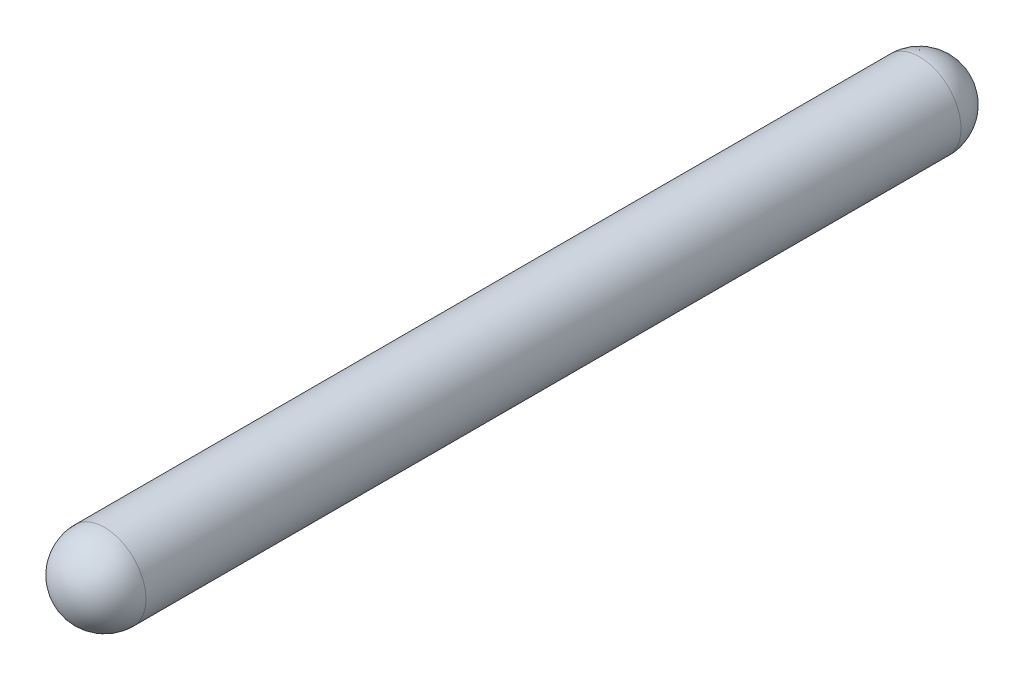
ISO-10303-21;
HEADER;
FILE_DESCRIPTION(('STEP AP214'),'2;1');
FILE_NAME('part.step','',(''),(''),'','','');
FILE_SCHEMA(('AUTOMOTIVE_DESIGN { 1 0 10303 214 1 1 1 1 }'));
ENDSEC;
DATA;
#1=APPLICATION_CONTEXT('core data for automotive mechanical design processes');
#2=APPLICATION_PROTOCOL_DEFINITION('international standard','automotive_design',2000,#1);
#3=PRODUCT_CONTEXT('',#1,'mechanical');
#4=PRODUCT('Part','Part','',(#3));
#5=PRODUCT_RELATED_PRODUCT_CATEGORY('part','',(#4));
#6=PRODUCT_DEFINITION_FORMATION('','',#4);
#7=PRODUCT_DEFINITION_CONTEXT('part definition',#1,'design');
#8=PRODUCT_DEFINITION('design','',#6,#7);
#9=PRODUCT_DEFINITION_SHAPE('','',#8);
#10=(LENGTH_UNIT() NAMED_UNIT(*) SI_UNIT(.MILLI.,.METRE.));
#11=(NAMED_UNIT(*) PLANE_ANGLE_UNIT() SI_UNIT($,.RADIAN.));
#12=(NAMED_UNIT(*) SI_UNIT($,.STERADIAN.) SOLID_ANGLE_UNIT());
#13=UNCERTAINTY_MEASURE_WITH_UNIT(LENGTH_MEASURE(1.E-05),#10,'distance_accuracy_value','');
#14=(GEOMETRIC_REPRESENTATION_CONTEXT(3) GLOBAL_UNCERTAINTY_ASSIGNED_CONTEXT((#13)) GLOBAL_UNIT_ASSIGNED_CONTEXT((#10,
#11,#12)) REPRESENTATION_CONTEXT('',''));
#15=CARTESIAN_POINT('',(0.,0.,0.));
#16=DIRECTION('',(0.,0.,1.));
#17=DIRECTION('',(1.,0.,0.));
#18=AXIS2_PLACEMENT_3D('',#15,#16,#17);
#19=CARTESIAN_POINT('',(0.,-7.62,-3.));
#20=DIRECTION('',(1.,0.,0.));
#21=DIRECTION('',(0.,-1.,0.));
#22=AXIS2_PLACEMENT_3D('',#19,#20,#21);
#23=SPHERICAL_SURFACE('',#22,0.331);
#24=CARTESIAN_POINT('',(0.,-7.62,-3.));
#25=DIRECTION('',(0.,0.,1.));
#26=DIRECTION('',(1.,0.,0.));
#27=AXIS2_PLACEMENT_3D('',#24,#25,#26);
#28=CIRCLE('',#27,0.331);
#29=CARTESIAN_POINT('',(0.331,-7.62,-3.));
#30=VERTEX_POINT('',#29);
#31=CARTESIAN_POINT('',(-0.331,-7.62,-3.));
#32=VERTEX_POINT('',#31);
#33=EDGE_CURVE('E42',#30,#32,#28,.T.);
#34=ORIENTED_EDGE('',*,*,#33,.F.);
#35=CARTESIAN_POINT('',(0.,-7.62,-3.));
#36=DIRECTION('',(0.,0.,1.));
#37=DIRECTION('',(1.,0.,0.));
#38=AXIS2_PLACEMENT_3D('',#35,#36,#37);
#39=CIRCLE('',#38,0.331);
#40=EDGE_CURVE('E26',#32,#30,#39,.T.);
#41=ORIENTED_EDGE('',*,*,#40,.F.);
#42=EDGE_LOOP('',(#34,#41));
#43=FACE_BOUND('',#42,.T.);
#44=ADVANCED_FACE('F17',(#43),#23,.T.);
#45=CARTESIAN_POINT('',(0.,-7.62,3.5));
#46=DIRECTION('',(1.,0.,0.));
#47=DIRECTION('',(0.,1.,0.));
#48=AXIS2_PLACEMENT_3D('',#45,#46,#47);
#49=SPHERICAL_SURFACE('',#48,0.331);
#50=CARTESIAN_POINT('',(0.,-7.62,3.5));
#51=DIRECTION('',(0.,0.,1.));
#52=DIRECTION('',(1.,0.,0.));
#53=AXIS2_PLACEMENT_3D('',#50,#51,#52);
#54=CIRCLE('',#53,0.331);
#55=CARTESIAN_POINT('',(0.331,-7.62,3.5));
#56=VERTEX_POINT('',#55);
#57=CARTESIAN_POINT('',(-0.331,-7.62,3.5));
#58=VERTEX_POINT('',#57);
#59=EDGE_CURVE('E11',#56,#58,#54,.F.);
#60=ORIENTED_EDGE('',*,*,#59,.F.);
#61=CARTESIAN_POINT('',(0.,-7.62,3.5));
#62=DIRECTION('',(0.,0.,1.));
#63=DIRECTION('',(1.,0.,0.));
#64=AXIS2_PLACEMENT_3D('',#61,#62,#63);
#65=CIRCLE('',#64,0.331);
#66=EDGE_CURVE('E34',#58,#56,#65,.F.);
#67=ORIENTED_EDGE('',*,*,#66,.F.);
#68=EDGE_LOOP('',(#60,#67));
#69=FACE_BOUND('',#68,.T.);
#70=ADVANCED_FACE('F49',(#69),#49,.T.);
#71=CARTESIAN_POINT('',(0.,-7.62,-3.));
#72=DIRECTION('',(0.,0.,1.));
#73=DIRECTION('',(1.,0.,0.));
#74=AXIS2_PLACEMENT_3D('',#71,#72,#73);
#75=CYLINDRICAL_SURFACE('',#74,0.331);
#76=ORIENTED_EDGE('',*,*,#66,.T.);
#77=ORIENTED_EDGE('',*,*,#59,.T.);
#78=EDGE_LOOP('',(#76,#77));
#79=FACE_BOUND('',#78,.T.);
#80=ORIENTED_EDGE('',*,*,#40,.T.);
#81=ORIENTED_EDGE('',*,*,#33,.T.);
#82=EDGE_LOOP('',(#80,#81));
#83=FACE_BOUND('',#82,.T.);
#84=ADVANCED_FACE('F45',(#79,#83),#75,.T.);
#85=CLOSED_SHELL('',(#44,#70,#84));
#86=MANIFOLD_SOLID_BREP('B1',#85);
#87=ADVANCED_BREP_SHAPE_REPRESENTATION('',(#18,#86),#14);
#88=SHAPE_DEFINITION_REPRESENTATION(#9,#87);
ENDSEC;
END-ISO-10303-21;
